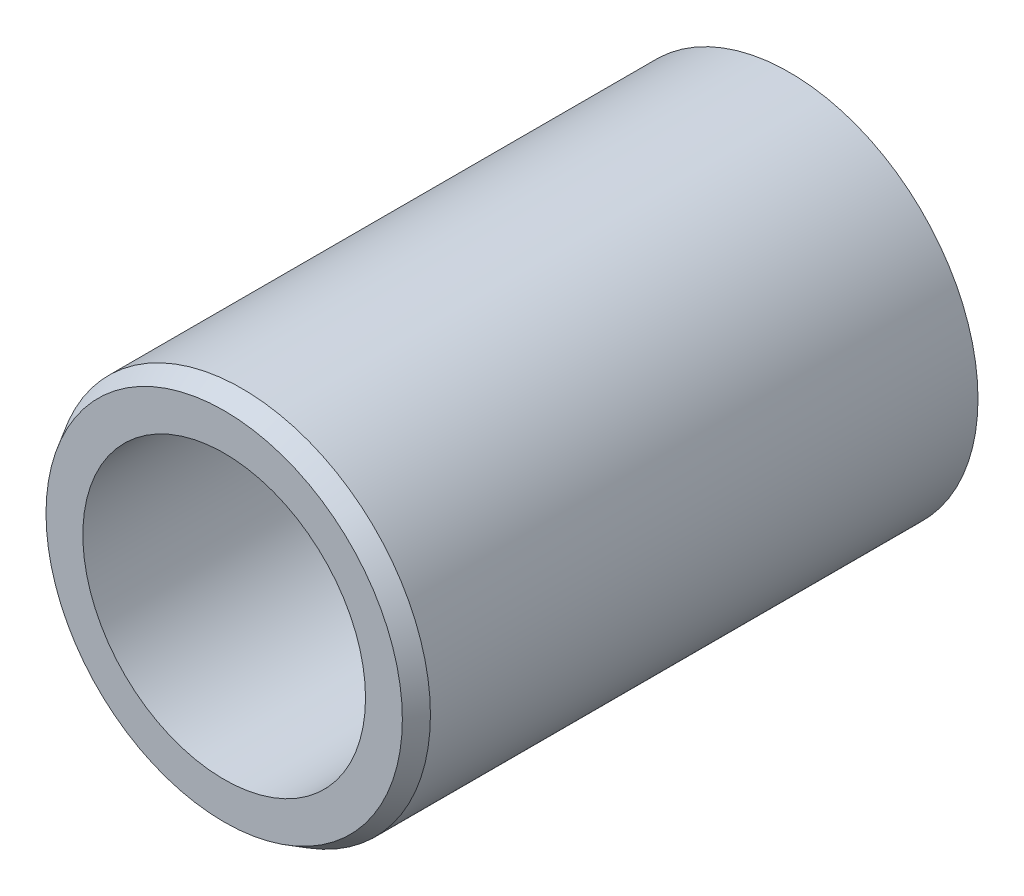
ISO-10303-21;
HEADER;
FILE_DESCRIPTION(('STEP AP214'),'2;1');
FILE_NAME('part.step','',(''),(''),'','','');
FILE_SCHEMA(('AUTOMOTIVE_DESIGN { 1 0 10303 214 1 1 1 1 }'));
ENDSEC;
DATA;
#1=APPLICATION_CONTEXT('core data for automotive mechanical design processes');
#2=APPLICATION_PROTOCOL_DEFINITION('international standard','automotive_design',2000,#1);
#3=PRODUCT_CONTEXT('',#1,'mechanical');
#4=PRODUCT('Part','Part','',(#3));
#5=PRODUCT_RELATED_PRODUCT_CATEGORY('part','',(#4));
#6=PRODUCT_DEFINITION_FORMATION('','',#4);
#7=PRODUCT_DEFINITION_CONTEXT('part definition',#1,'design');
#8=PRODUCT_DEFINITION('design','',#6,#7);
#9=PRODUCT_DEFINITION_SHAPE('','',#8);
#10=(LENGTH_UNIT() NAMED_UNIT(*) SI_UNIT(.MILLI.,.METRE.));
#11=(NAMED_UNIT(*) PLANE_ANGLE_UNIT() SI_UNIT($,.RADIAN.));
#12=(NAMED_UNIT(*) SI_UNIT($,.STERADIAN.) SOLID_ANGLE_UNIT());
#13=UNCERTAINTY_MEASURE_WITH_UNIT(LENGTH_MEASURE(1.E-05),#10,'distance_accuracy_value','');
#14=(GEOMETRIC_REPRESENTATION_CONTEXT(3) GLOBAL_UNCERTAINTY_ASSIGNED_CONTEXT((#13)) GLOBAL_UNIT_ASSIGNED_CONTEXT((#10,
#11,#12)) REPRESENTATION_CONTEXT('',''));
#15=CARTESIAN_POINT('',(0.,0.,0.));
#16=DIRECTION('',(0.,0.,1.));
#17=DIRECTION('',(1.,0.,0.));
#18=AXIS2_PLACEMENT_3D('',#15,#16,#17);
#19=CARTESIAN_POINT('',(0.,0.,5.0125));
#20=DIRECTION('',(0.,0.,1.));
#21=DIRECTION('',(1.,0.,0.));
#22=AXIS2_PLACEMENT_3D('',#19,#20,#21);
#23=CYLINDRICAL_SURFACE('',#22,2.38125);
#24=CARTESIAN_POINT('',(0.,0.,0.50000000004502));
#25=DIRECTION('',(0.,0.,-1.));
#26=DIRECTION('',(1.,0.,0.));
#27=AXIS2_PLACEMENT_3D('',#24,#25,#26);
#28=CIRCLE('',#27,2.3812499999849);
#29=CARTESIAN_POINT('',(2.3812499999849,0.,0.50000000004502));
#30=VERTEX_POINT('',#29);
#31=EDGE_CURVE('E30',#30,#30,#28,.T.);
#32=ORIENTED_EDGE('',*,*,#31,.T.);
#33=EDGE_LOOP('',(#32));
#34=FACE_BOUND('',#33,.T.);
#35=CARTESIAN_POINT('',(0.,0.,9.525));
#36=DIRECTION('',(0.,0.,1.));
#37=DIRECTION('',(1.,0.,0.));
#38=AXIS2_PLACEMENT_3D('',#35,#36,#37);
#39=CIRCLE('',#38,2.38125);
#40=CARTESIAN_POINT('',(2.38125,0.,9.525));
#41=VERTEX_POINT('',#40);
#42=EDGE_CURVE('E18',#41,#41,#39,.F.);
#43=ORIENTED_EDGE('',*,*,#42,.F.);
#44=EDGE_LOOP('',(#43));
#45=FACE_BOUND('',#44,.T.);
#46=ADVANCED_FACE('F15',(#34,#45),#23,.F.);
#47=CARTESIAN_POINT('',(0.,0.,5.6843418860808E-11));
#48=DIRECTION('',(0.,0.,-1.));
#49=DIRECTION('',(-1.,0.,0.));
#50=AXIS2_PLACEMENT_3D('',#47,#48,#49);
#51=CONICAL_SURFACE('',#50,2.66992513456898,0.523598775628479);
#52=CARTESIAN_POINT('',(0.,0.,-5.6843418860808E-11));
#53=DIRECTION('',(0.,0.,-1.));
#54=DIRECTION('',(-1.,0.,0.));
#55=AXIS2_PLACEMENT_3D('',#52,#53,#54);
#56=CIRCLE('',#55,2.66992513463462);
#57=CARTESIAN_POINT('',(-2.66992513463462,0.,-5.6843418860808E-11));
#58=VERTEX_POINT('',#57);
#59=EDGE_CURVE('E34',#58,#58,#56,.F.);
#60=ORIENTED_EDGE('',*,*,#59,.F.);
#61=EDGE_LOOP('',(#60));
#62=FACE_BOUND('',#61,.T.);
#63=ORIENTED_EDGE('',*,*,#31,.F.);
#64=EDGE_LOOP('',(#63));
#65=FACE_BOUND('',#64,.T.);
#66=ADVANCED_FACE('F44',(#62,#65),#51,.F.);
#67=CARTESIAN_POINT('',(2.6915224596,0.,9.525));
#68=DIRECTION('',(0.,0.,1.));
#69=DIRECTION('',(1.,0.,0.));
#70=AXIS2_PLACEMENT_3D('',#67,#68,#69);
#71=PLANE('',#70);
#72=CARTESIAN_POINT('',(0.,0.,9.52499999999645));
#73=DIRECTION('',(0.,0.,-1.));
#74=DIRECTION('',(-1.,0.,0.));
#75=AXIS2_PLACEMENT_3D('',#72,#73,#74);
#76=CIRCLE('',#75,3.00179491919903);
#77=CARTESIAN_POINT('',(-3.00179491919903,0.,9.52499999999645));
#78=VERTEX_POINT('',#77);
#79=EDGE_CURVE('E27',#78,#78,#76,.T.);
#80=ORIENTED_EDGE('',*,*,#79,.F.);
#81=EDGE_LOOP('',(#80));
#82=FACE_BOUND('',#81,.T.);
#83=ORIENTED_EDGE('',*,*,#42,.T.);
#84=EDGE_LOOP('',(#83));
#85=FACE_BOUND('',#84,.T.);
#86=ADVANCED_FACE('F41',(#82,#85),#71,.T.);
#87=CARTESIAN_POINT('',(2.9224625673,0.,0.));
#88=DIRECTION('',(0.,0.,-1.));
#89=DIRECTION('',(-1.,0.,0.));
#90=AXIS2_PLACEMENT_3D('',#87,#88,#89);
#91=PLANE('',#90);
#92=ORIENTED_EDGE('',*,*,#59,.T.);
#93=EDGE_LOOP('',(#92));
#94=FACE_BOUND('',#93,.T.);
#95=CARTESIAN_POINT('',(0.,0.,0.));
#96=DIRECTION('',(0.,0.,1.));
#97=DIRECTION('',(1.,0.,0.));
#98=AXIS2_PLACEMENT_3D('',#95,#96,#97);
#99=CIRCLE('',#98,3.175);
#100=CARTESIAN_POINT('',(3.175,0.,0.));
#101=VERTEX_POINT('',#100);
#102=EDGE_CURVE('E22',#101,#101,#99,.T.);
#103=ORIENTED_EDGE('',*,*,#102,.F.);
#104=EDGE_LOOP('',(#103));
#105=FACE_BOUND('',#104,.T.);
#106=ADVANCED_FACE('F59',(#94,#105),#91,.T.);
#107=CARTESIAN_POINT('',(0.,0.,9.2250000001286));
#108=DIRECTION('',(0.,0.,-1.));
#109=DIRECTION('',(-1.,0.,0.));
#110=AXIS2_PLACEMENT_3D('',#107,#108,#109);
#111=CONICAL_SURFACE('',#110,3.17499999988513,0.52359877561207);
#112=ORIENTED_EDGE('',*,*,#79,.T.);
#113=EDGE_LOOP('',(#112));
#114=FACE_BOUND('',#113,.T.);
#115=CARTESIAN_POINT('',(0.,0.,9.225));
#116=DIRECTION('',(0.,0.,1.));
#117=DIRECTION('',(1.,0.,0.));
#118=AXIS2_PLACEMENT_3D('',#115,#116,#117);
#119=CIRCLE('',#118,3.175);
#120=CARTESIAN_POINT('',(3.175,0.,9.225));
#121=VERTEX_POINT('',#120);
#122=EDGE_CURVE('E10',#121,#121,#119,.F.);
#123=ORIENTED_EDGE('',*,*,#122,.F.);
#124=EDGE_LOOP('',(#123));
#125=FACE_BOUND('',#124,.T.);
#126=ADVANCED_FACE('F53',(#114,#125),#111,.T.);
#127=CARTESIAN_POINT('',(0.,0.,4.6125));
#128=DIRECTION('',(0.,0.,1.));
#129=DIRECTION('',(1.,0.,0.));
#130=AXIS2_PLACEMENT_3D('',#127,#128,#129);
#131=CYLINDRICAL_SURFACE('',#130,3.175);
#132=ORIENTED_EDGE('',*,*,#102,.T.);
#133=EDGE_LOOP('',(#132));
#134=FACE_BOUND('',#133,.T.);
#135=ORIENTED_EDGE('',*,*,#122,.T.);
#136=EDGE_LOOP('',(#135));
#137=FACE_BOUND('',#136,.T.);
#138=ADVANCED_FACE('F51',(#134,#137),#131,.T.);
#139=CLOSED_SHELL('',(#46,#66,#86,#106,#126,#138));
#140=MANIFOLD_SOLID_BREP('B1',#139);
#141=ADVANCED_BREP_SHAPE_REPRESENTATION('',(#18,#140),#14);
#142=SHAPE_DEFINITION_REPRESENTATION(#9,#141);
ENDSEC;
END-ISO-10303-21;
